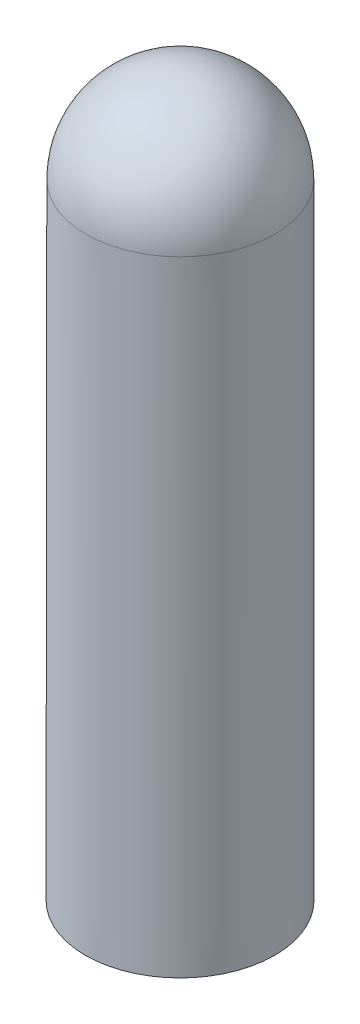
ISO-10303-21;
HEADER;
FILE_DESCRIPTION(('STEP AP214'),'2;1');
FILE_NAME('part.step','',(''),(''),'','','');
FILE_SCHEMA(('AUTOMOTIVE_DESIGN { 1 0 10303 214 1 1 1 1 }'));
ENDSEC;
DATA;
#1=APPLICATION_CONTEXT('core data for automotive mechanical design processes');
#2=APPLICATION_PROTOCOL_DEFINITION('international standard','automotive_design',2000,#1);
#3=PRODUCT_CONTEXT('',#1,'mechanical');
#4=PRODUCT('Part','Part','',(#3));
#5=PRODUCT_RELATED_PRODUCT_CATEGORY('part','',(#4));
#6=PRODUCT_DEFINITION_FORMATION('','',#4);
#7=PRODUCT_DEFINITION_CONTEXT('part definition',#1,'design');
#8=PRODUCT_DEFINITION('design','',#6,#7);
#9=PRODUCT_DEFINITION_SHAPE('','',#8);
#10=(LENGTH_UNIT() NAMED_UNIT(*) SI_UNIT(.MILLI.,.METRE.));
#11=(NAMED_UNIT(*) PLANE_ANGLE_UNIT() SI_UNIT($,.RADIAN.));
#12=(NAMED_UNIT(*) SI_UNIT($,.STERADIAN.) SOLID_ANGLE_UNIT());
#13=UNCERTAINTY_MEASURE_WITH_UNIT(LENGTH_MEASURE(1.E-05),#10,'distance_accuracy_value','');
#14=(GEOMETRIC_REPRESENTATION_CONTEXT(3) GLOBAL_UNCERTAINTY_ASSIGNED_CONTEXT((#13)) GLOBAL_UNIT_ASSIGNED_CONTEXT((#10,
#11,#12)) REPRESENTATION_CONTEXT('',''));
#15=CARTESIAN_POINT('',(0.,0.,0.));
#16=DIRECTION('',(0.,0.,1.));
#17=DIRECTION('',(1.,0.,0.));
#18=AXIS2_PLACEMENT_3D('',#15,#16,#17);
#19=CARTESIAN_POINT('',(-0.00379145897178241,-1.99999640620649,0.));
#20=DIRECTION('',(0.,0.,-1.));
#21=DIRECTION('',(0.999999875558147,-0.000498882441112287,0.));
#22=AXIS2_PLACEMENT_3D('',#19,#20,#21);
#23=CIRCLE('',#22,2.);
#24=TRIMMED_CURVE('',#23,(PARAMETER_VALUE(-1.56939947863533)),
(PARAMETER_VALUE(1.56939947863533)),.T.,.PARAMETER.);
#25=CARTESIAN_POINT('',(-0.000997763908812905,-1.99999779993207,0.));
#26=DIRECTION('',(-0.000498882441112287,-0.999999875558147,0.));
#27=AXIS1_PLACEMENT('',#25,#26);
#28=SURFACE_OF_REVOLUTION('',#24,#27);
#29=CARTESIAN_POINT('',(0.,0.,0.));
#30=VERTEX_POINT('',#29);
#31=VERTEX_LOOP('',#30);
#32=FACE_BOUND('',#31,.T.);
#33=CARTESIAN_POINT('',(-0.00099915942727456,-2.00279508877808,0.));
#34=DIRECTION('',(-0.000498882441112287,-0.999999875558147,0.));
#35=DIRECTION('',(0.999999875558147,-0.000498882441112287,0.));
#36=AXIS2_PLACEMENT_3D('',#33,#34,#35);
#37=CIRCLE('',#36,1.99720434838171);
#38=CARTESIAN_POINT('',(1.99620494041863,-2.0037914589588,0.));
#39=VERTEX_POINT('',#38);
#40=EDGE_CURVE('E11',#39,#39,#37,.T.);
#41=ORIENTED_EDGE('',*,*,#40,.F.);
#42=EDGE_LOOP('',(#41));
#43=FACE_BOUND('',#42,.T.);
#44=ADVANCED_FACE('F33',(#32,#43),#28,.T.);
#45=CARTESIAN_POINT('',(-0.00758962045083402,-15.2132424012481,0.));
#46=DIRECTION('',(-0.000498882441112287,-0.999999875558147,0.));
#47=DIRECTION('',(0.999999875558147,-0.000498882441112287,0.));
#48=AXIS2_PLACEMENT_3D('',#45,#46,#47);
#49=CONICAL_SURFACE('',#48,2.0037948102254,0.000498882461806395);
#50=ORIENTED_EDGE('',*,*,#40,.T.);
#51=EDGE_LOOP('',(#50));
#52=FACE_BOUND('',#51,.T.);
#53=CARTESIAN_POINT('',(-0.00758962045083402,-15.2132424012481,0.));
#54=DIRECTION('',(-0.000498882441112287,-0.999999875558147,0.));
#55=DIRECTION('',(0.999999875558147,-0.000498882441112287,0.));
#56=AXIS2_PLACEMENT_3D('',#53,#54,#55);
#57=CIRCLE('',#56,2.0037948102254);
#58=CARTESIAN_POINT('',(1.99620494041863,-15.2142420592945,0.));
#59=VERTEX_POINT('',#58);
#60=EDGE_CURVE('E40',#59,#59,#57,.T.);
#61=ORIENTED_EDGE('',*,*,#60,.F.);
#62=EDGE_LOOP('',(#61));
#63=FACE_BOUND('',#62,.T.);
#64=ADVANCED_FACE('F48',(#52,#63),#49,.T.);
#65=CARTESIAN_POINT('',(-0.00759011916274255,-15.2142420592945,0.));
#66=DIRECTION('',(0.000498882441112287,0.999999875558147,0.));
#67=DIRECTION('',(-0.999999875558147,0.000498882441112287,0.));
#68=AXIS2_PLACEMENT_3D('',#65,#66,#67);
#69=CONICAL_SURFACE('',#68,0.,1.57029744433309);
#70=ORIENTED_EDGE('',*,*,#60,.T.);
#71=EDGE_LOOP('',(#70));
#72=FACE_BOUND('',#71,.T.);
#73=CARTESIAN_POINT('',(-0.00759011916274255,-15.2142420592945,0.));
#74=VERTEX_POINT('',#73);
#75=VERTEX_LOOP('',#74);
#76=FACE_BOUND('',#75,.T.);
#77=ADVANCED_FACE('F53',(#72,#76),#69,.T.);
#78=CLOSED_SHELL('',(#44,#64,#77));
#79=MANIFOLD_SOLID_BREP('B2',#78);
#80=ADVANCED_BREP_SHAPE_REPRESENTATION('',(#18,#79),#14);
#81=SHAPE_DEFINITION_REPRESENTATION(#9,#80);
ENDSEC;
END-ISO-10303-21;
